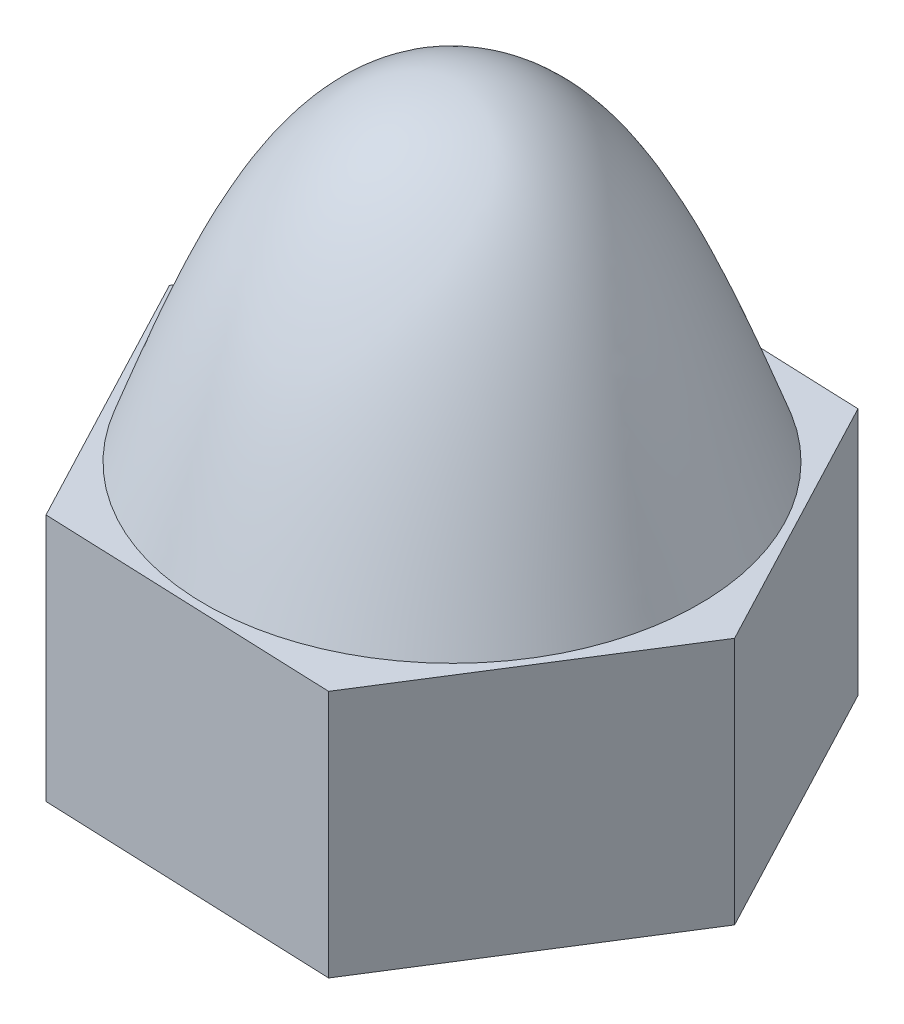
ISO-10303-21;
HEADER;
FILE_DESCRIPTION(('STEP AP214'),'2;1');
FILE_NAME('part.step','',(''),(''),'','','');
FILE_SCHEMA(('AUTOMOTIVE_DESIGN { 1 0 10303 214 1 1 1 1 }'));
ENDSEC;
DATA;
#1=APPLICATION_CONTEXT('core data for automotive mechanical design processes');
#2=APPLICATION_PROTOCOL_DEFINITION('international standard','automotive_design',2000,#1);
#3=PRODUCT_CONTEXT('',#1,'mechanical');
#4=PRODUCT('Part','Part','',(#3));
#5=PRODUCT_RELATED_PRODUCT_CATEGORY('part','',(#4));
#6=PRODUCT_DEFINITION_FORMATION('','',#4);
#7=PRODUCT_DEFINITION_CONTEXT('part definition',#1,'design');
#8=PRODUCT_DEFINITION('design','',#6,#7);
#9=PRODUCT_DEFINITION_SHAPE('','',#8);
#10=(LENGTH_UNIT() NAMED_UNIT(*) SI_UNIT(.MILLI.,.METRE.));
#11=(NAMED_UNIT(*) PLANE_ANGLE_UNIT() SI_UNIT($,.RADIAN.));
#12=(NAMED_UNIT(*) SI_UNIT($,.STERADIAN.) SOLID_ANGLE_UNIT());
#13=UNCERTAINTY_MEASURE_WITH_UNIT(LENGTH_MEASURE(1.E-05),#10,'distance_accuracy_value','');
#14=(GEOMETRIC_REPRESENTATION_CONTEXT(3) GLOBAL_UNCERTAINTY_ASSIGNED_CONTEXT((#13)) GLOBAL_UNIT_ASSIGNED_CONTEXT((#10,
#11,#12)) REPRESENTATION_CONTEXT('',''));
#15=CARTESIAN_POINT('',(0.,0.,0.));
#16=DIRECTION('',(0.,0.,1.));
#17=DIRECTION('',(1.,0.,0.));
#18=AXIS2_PLACEMENT_3D('',#15,#16,#17);
#19=CARTESIAN_POINT('',(0.,4.445,0.));
#20=DIRECTION('',(0.,1.,0.));
#21=DIRECTION('',(0.,0.,1.));
#22=AXIS2_PLACEMENT_3D('',#19,#20,#21);
#23=PLANE('',#22);
#24=DIRECTION('',(0.999234008719932,0.,0.039133052749487));
#25=VECTOR('',#24,1.);
#26=CARTESIAN_POINT('',(-2.81164997647716,4.445,4.45744841977833));
#27=LINE('',#26,#25);
#28=CARTESIAN_POINT('',(-2.81164997647716,4.445,4.45744841977833));
#29=VERTEX_POINT('',#28);
#30=CARTESIAN_POINT('',(2.45443857934825,4.445,4.66368451606831));
#31=VERTEX_POINT('',#30);
#32=EDGE_CURVE('E159',#29,#31,#27,.T.);
#33=ORIENTED_EDGE('',*,*,#32,.T.);
#34=DIRECTION('',(0.533507222168658,0.,-0.845795509502079));
#35=VECTOR('',#34,1.);
#36=CARTESIAN_POINT('',(2.45443857934825,4.445,4.66368451606831));
#37=LINE('',#36,#35);
#38=CARTESIAN_POINT('',(5.26608855582541,4.445,0.206236096289978));
#39=VERTEX_POINT('',#38);
#40=EDGE_CURVE('E116',#31,#39,#37,.T.);
#41=ORIENTED_EDGE('',*,*,#40,.T.);
#42=DIRECTION('',(-0.465726786551274,0.,-0.884928562251566));
#43=VECTOR('',#42,1.);
#44=CARTESIAN_POINT('',(5.26608855582541,4.445,0.206236096289978));
#45=LINE('',#44,#43);
#46=CARTESIAN_POINT('',(2.81164997647716,4.445,-4.45744841977833));
#47=VERTEX_POINT('',#46);
#48=EDGE_CURVE('E131',#39,#47,#45,.T.);
#49=ORIENTED_EDGE('',*,*,#48,.T.);
#50=DIRECTION('',(-0.999234008719933,0.,-0.0391330527494867));
#51=VECTOR('',#50,1.);
#52=CARTESIAN_POINT('',(2.81164997647716,4.445,-4.45744841977833));
#53=LINE('',#52,#51);
#54=CARTESIAN_POINT('',(-2.45443857934825,4.445,-4.66368451606831));
#55=VERTEX_POINT('',#54);
#56=EDGE_CURVE('E125',#47,#55,#53,.T.);
#57=ORIENTED_EDGE('',*,*,#56,.T.);
#58=DIRECTION('',(-0.533507222168658,0.,0.845795509502079));
#59=VECTOR('',#58,1.);
#60=CARTESIAN_POINT('',(-2.45443857934825,4.445,-4.66368451606831));
#61=LINE('',#60,#59);
#62=CARTESIAN_POINT('',(-5.26608855582541,4.445,-0.206236096289979));
#63=VERTEX_POINT('',#62);
#64=EDGE_CURVE('E129',#55,#63,#61,.T.);
#65=ORIENTED_EDGE('',*,*,#64,.T.);
#66=DIRECTION('',(0.465726786551274,0.,0.884928562251566));
#67=VECTOR('',#66,1.);
#68=CARTESIAN_POINT('',(-5.26608855582541,4.445,-0.206236096289979));
#69=LINE('',#68,#67);
#70=EDGE_CURVE('E78',#63,#29,#69,.T.);
#71=ORIENTED_EDGE('',*,*,#70,.T.);
#72=EDGE_LOOP('',(#33,#41,#49,#57,#65,#71));
#73=FACE_BOUND('',#72,.T.);
#74=CARTESIAN_POINT('',(4.35662282921079,4.445,0.743439092326554));
#75=CARTESIAN_POINT('',(4.32174660966076,4.445,0.947805953624223));
#76=CARTESIAN_POINT('',(4.27272886803755,4.445,1.1497762990178));
#77=CARTESIAN_POINT('',(4.14669023723,4.445,1.54493851260189));
#78=CARTESIAN_POINT('',(4.0696603076262,4.445,1.73812752410831));
#79=CARTESIAN_POINT('',(3.92528740802944,4.445,2.03672217537225));
#80=CARTESIAN_POINT('',(3.86641259978012,4.445,2.1463075688652));
#81=CARTESIAN_POINT('',(3.73955707927642,4.445,2.36011960040588));
#82=CARTESIAN_POINT('',(3.67157521385771,4.445,2.46434555750821));
#83=CARTESIAN_POINT('',(3.52701154421101,4.445,2.66670114308955));
#84=CARTESIAN_POINT('',(3.45042658302859,4.445,2.76482851300616));
#85=CARTESIAN_POINT('',(3.28922958510174,4.445,2.95431114364019));
#86=CARTESIAN_POINT('',(3.2046148016584,4.445,3.04566406790219));
#87=CARTESIAN_POINT('',(3.02845314386114,4.445,3.22049898102683));
#88=CARTESIAN_POINT('',(2.93694306018866,4.445,3.30401805403218));
#89=CARTESIAN_POINT('',(2.74727869081726,4.445,3.46313663175775));
#90=CARTESIAN_POINT('',(2.64912438577245,4.445,3.53873611341698));
#91=CARTESIAN_POINT('',(2.44685223007545,4.445,3.681502329137));
#92=CARTESIAN_POINT('',(2.34273392601378,4.445,3.748668420812));
#93=CARTESIAN_POINT('',(2.1292960939979,4.445,3.874063853559));
#94=CARTESIAN_POINT('',(2.01997836514628,4.445,3.93229625681199));
#95=CARTESIAN_POINT('',(1.79564032251638,4.445,4.04000556842794));
#96=CARTESIAN_POINT('',(1.68057084029235,4.445,4.08938012841029));
#97=CARTESIAN_POINT('',(1.44670190072492,4.445,4.17817516175765));
#98=CARTESIAN_POINT('',(1.32790386201786,4.445,4.21759937061281));
#99=CARTESIAN_POINT('',(1.08735330694327,4.445,4.28619848653747));
#100=CARTESIAN_POINT('',(0.965600108000928,4.445,4.31537100114471));
#101=CARTESIAN_POINT('',(0.720092730473457,4.445,4.36319731561211));
#102=CARTESIAN_POINT('',(0.596339342986113,4.445,4.38185517424992));
#103=CARTESIAN_POINT('',(0.348925387655618,4.445,4.40838790727491));
#104=CARTESIAN_POINT('',(0.225276079028581,4.445,4.41636792101823));
#105=CARTESIAN_POINT('',(-0.0222551581239229,4.445,4.42185851413617));
#106=CARTESIAN_POINT('',(-0.146137088319347,4.445,4.41936901806228));
#107=CARTESIAN_POINT('',(-0.393279203472097,4.445,4.40400154869783));
#108=CARTESIAN_POINT('',(-0.516539238901565,4.445,4.3911211866009));
#109=CARTESIAN_POINT('',(-0.761577247689886,4.445,4.35523029317141));
#110=CARTESIAN_POINT('',(-0.883355174571041,4.445,4.33221944499203));
#111=CARTESIAN_POINT('',(-1.12538543180522,4.445,4.27596019345461));
#112=CARTESIAN_POINT('',(-1.24562214579,4.445,4.24264445724496));
#113=CARTESIAN_POINT('',(-1.48283327386176,4.445,4.1659385135933));
#114=CARTESIAN_POINT('',(-1.59980786353029,4.445,4.12254884955018));
#115=CARTESIAN_POINT('',(-1.82960197766819,4.445,4.02597983248773));
#116=CARTESIAN_POINT('',(-1.94242277112203,4.445,3.97280349958063));
#117=CARTESIAN_POINT('',(-2.1631229874928,4.445,3.85703115818201));
#118=CARTESIAN_POINT('',(-2.27100240963344,4.445,3.79443514821068));
#119=CARTESIAN_POINT('',(-2.48024703320178,4.445,3.66081113795548));
#120=CARTESIAN_POINT('',(-2.58165564755156,4.445,3.58985109828074));
#121=CARTESIAN_POINT('',(-2.77812452189076,4.445,3.43968046136258));
#122=CARTESIAN_POINT('',(-2.87318633476911,4.445,3.36047189453907));
#123=CARTESIAN_POINT('',(-3.05634719393342,4.445,3.19437641034296));
#124=CARTESIAN_POINT('',(-3.14444661016464,4.445,3.10748990145629));
#125=CARTESIAN_POINT('',(-3.31316102389343,4.445,2.92661226222991));
#126=CARTESIAN_POINT('',(-3.39376859369692,4.445,2.83261424524259));
#127=CARTESIAN_POINT('',(-3.6241649073268,4.445,2.54006005302365));
#128=CARTESIAN_POINT('',(-3.76173673322735,4.445,2.33166194350997));
#129=CARTESIAN_POINT('',(-4.00008269430208,4.445,1.8947881075221));
#130=CARTESIAN_POINT('',(-4.10085859547328,4.445,1.66631334526723));
#131=CARTESIAN_POINT('',(-4.22227558593048,4.445,1.31302048118642));
#132=CARTESIAN_POINT('',(-4.25784553310922,4.445,1.19315474609166));
#133=CARTESIAN_POINT('',(-4.31862987808154,4.445,0.950914356536398));
#134=CARTESIAN_POINT('',(-4.34385404788537,4.445,0.828542184775782));
#135=CARTESIAN_POINT('',(-4.38377444030423,4.445,0.58203988998001));
#136=CARTESIAN_POINT('',(-4.39846561353281,4.445,0.457908952852633));
#137=CARTESIAN_POINT('',(-4.41720066340692,4.445,0.208818565773393));
#138=CARTESIAN_POINT('',(-4.42124234662736,4.445,0.0838589504550177));
#139=CARTESIAN_POINT('',(-4.41869891906101,4.445,-0.164456386271367));
#140=CARTESIAN_POINT('',(-4.41224008926696,4.445,-0.28781344698269));
#141=CARTESIAN_POINT('',(-4.38908166933431,4.445,-0.533562991643465));
#142=CARTESIAN_POINT('',(-4.37238169569248,4.445,-0.655955439296907));
#143=CARTESIAN_POINT('',(-4.32898110670289,4.445,-0.898982379617695));
#144=CARTESIAN_POINT('',(-4.30227831663326,4.445,-1.01961648407243));
#145=CARTESIAN_POINT('',(-4.23891032773645,4.445,-1.25817929634705));
#146=CARTESIAN_POINT('',(-4.2022500752665,4.445,-1.37610931596017));
#147=CARTESIAN_POINT('',(-4.11858811223253,4.445,-1.61001845621786));
#148=CARTESIAN_POINT('',(-4.07145524156516,4.445,-1.72595071300299));
#149=CARTESIAN_POINT('',(-3.96746228753433,4.445,-1.95333748940981));
#150=CARTESIAN_POINT('',(-3.91060410913626,4.445,-2.0647928806776));
#151=CARTESIAN_POINT('',(-3.78759716478127,4.445,-2.28239332844595));
#152=CARTESIAN_POINT('',(-3.72145273089637,4.445,-2.3885408299603));
#153=CARTESIAN_POINT('',(-3.58032605984945,4.445,-2.59489464870174));
#154=CARTESIAN_POINT('',(-3.50533567048114,4.445,-2.69509535568276));
#155=CARTESIAN_POINT('',(-3.27007661002213,4.445,-2.98304054375815));
#156=CARTESIAN_POINT('',(-3.09778741425249,4.445,-3.16117366612498));
#157=CARTESIAN_POINT('',(-2.72603802856108,4.445,-3.48638148191968));
#158=CARTESIAN_POINT('',(-2.52657636499327,4.445,-3.63345448975856));
#159=CARTESIAN_POINT('',(-2.21011113532197,4.445,-3.82850059105117));
#160=CARTESIAN_POINT('',(-2.10098292840892,4.445,-3.88956458855192));
#161=CARTESIAN_POINT('',(-1.87804749346549,4.445,-4.0022366243601));
#162=CARTESIAN_POINT('',(-1.76424486846822,4.445,-4.05385370436048));
#163=CARTESIAN_POINT('',(-1.53268011035905,4.445,-4.14727935584907));
#164=CARTESIAN_POINT('',(-1.414917700763,4.445,-4.18908724079687));
#165=CARTESIAN_POINT('',(-1.17623714221631,4.445,-4.26256197518627));
#166=CARTESIAN_POINT('',(-1.0553182667417,4.445,-4.2942264672627));
#167=CARTESIAN_POINT('',(-0.811732915307503,4.445,-4.34702114063868));
#168=CARTESIAN_POINT('',(-0.689075885892851,4.445,-4.36819490938892));
#169=CARTESIAN_POINT('',(-0.44240548769916,4.445,-4.40003400185899));
#170=CARTESIAN_POINT('',(-0.31839212218866,4.445,-4.41069935089668));
#171=CARTESIAN_POINT('',(-0.0698733053839038,4.445,-4.42146314285566));
#172=CARTESIAN_POINT('',(0.0546322749086569,4.445,-4.4215586027531));
#173=CARTESIAN_POINT('',(0.303210824147816,4.445,-4.41122714906609));
#174=CARTESIAN_POINT('',(0.427283764917807,4.445,-4.40079956253012));
#175=CARTESIAN_POINT('',(0.673463840589031,4.445,-4.36973629373552));
#176=CARTESIAN_POINT('',(0.795577955241885,4.445,-4.34915575007941));
#177=CARTESIAN_POINT('',(1.03768303686839,4.445,-4.29796375858013));
#178=CARTESIAN_POINT('',(1.15767409643252,4.445,-4.26735274932689));
#179=CARTESIAN_POINT('',(1.39463285553744,4.445,-4.19616512795155));
#180=CARTESIAN_POINT('',(1.51160132398927,4.445,-4.15559107844773));
#181=CARTESIAN_POINT('',(1.74169515810044,4.445,-4.06471107109416));
#182=CARTESIAN_POINT('',(1.85482051737433,4.445,-4.01440509707539));
#183=CARTESIAN_POINT('',(2.07715877970649,4.445,-3.90403140338477));
#184=CARTESIAN_POINT('',(2.18634010861473,4.445,-3.84390006596982));
#185=CARTESIAN_POINT('',(2.39923445311476,4.445,-3.71454803194461));
#186=CARTESIAN_POINT('',(2.50294536931013,4.445,-3.64532388082145));
#187=CARTESIAN_POINT('',(2.70410639559251,4.445,-3.49834973024277));
#188=CARTESIAN_POINT('',(2.80155771999236,4.445,-3.42060139238399));
#189=CARTESIAN_POINT('',(2.9895847238408,4.445,-3.2571304209544));
#190=CARTESIAN_POINT('',(3.08015795276731,4.445,-3.17140496928664));
#191=CARTESIAN_POINT('',(3.25323235240299,4.445,-2.99319868833567));
#192=CARTESIAN_POINT('',(3.33578028567301,4.445,-2.90076325996864));
#193=CARTESIAN_POINT('',(3.49288218353617,4.445,-2.70933196240181));
#194=CARTESIAN_POINT('',(3.56743612770504,4.445,-2.61033607644139));
#195=CARTESIAN_POINT('',(3.70805800775874,4.445,-2.40644575416624));
#196=CARTESIAN_POINT('',(3.77412336599426,4.445,-2.30154953999147));
#197=CARTESIAN_POINT('',(3.89724959305672,4.445,-2.08664687609502));
#198=CARTESIAN_POINT('',(3.95431354127313,4.445,-1.97664219072805));
#199=CARTESIAN_POINT('',(4.05959926523972,4.445,-1.75104236907643));
#200=CARTESIAN_POINT('',(4.10771998258397,4.445,-1.63540003709943));
#201=CARTESIAN_POINT('',(4.19395559726147,4.445,-1.40049146772567));
#202=CARTESIAN_POINT('',(4.2320741496722,4.445,-1.28122657194367));
#203=CARTESIAN_POINT('',(4.29799271041467,4.445,-1.03993754123425));
#204=CARTESIAN_POINT('',(4.32579798750337,4.445,-0.917914849083959));
#205=CARTESIAN_POINT('',(4.37088106508812,4.445,-0.671980102196804));
#206=CARTESIAN_POINT('',(4.38816060075026,4.445,-0.548068362323102));
#207=CARTESIAN_POINT('',(4.41875709384328,4.445,-0.229316949555729));
#208=CARTESIAN_POINT('',(4.42441170231475,4.445,-0.0336875699099584));
#209=CARTESIAN_POINT('',(4.40976040557536,4.445,0.356482243147101));
#210=CARTESIAN_POINT('',(4.38945961060927,4.445,0.551022883342163));
#211=CARTESIAN_POINT('',(4.35662282921079,4.445,0.743439092326554));
#212=B_SPLINE_CURVE_WITH_KNOTS('',3,(#74,#75,#76,#77,#78,#79,#80,#81,#82,#83,#84,#85,#86,#87,
#88,#89,#90,#91,#92,#93,#94,#95,#96,#97,#98,#99,#100,#101,#102,#103,#104,#105,#106,#107,#108,
#109,#110,#111,#112,#113,#114,#115,#116,#117,#118,#119,#120,#121,#122,#123,#124,#125,#126,#127,
#128,#129,#130,#131,#132,#133,#134,#135,#136,#137,#138,#139,#140,#141,#142,#143,#144,#145,#146,
#147,#148,#149,#150,#151,#152,#153,#154,#155,#156,#157,#158,#159,#160,#161,#162,#163,#164,#165,
#166,#167,#168,#169,#170,#171,#172,#173,#174,#175,#176,#177,#178,#179,#180,#181,#182,#183,#184,
#185,#186,#187,#188,#189,#190,#191,#192,#193,#194,#195,#196,#197,#198,#199,#200,#201,#202,#203,
#204,#205,#206,#207,#208,#209,#210,#211),.UNSPECIFIED.,.T.,.F.,(4,2,2,2,2,2,2,2,2,2,2,2,2,2,2,2,
2,2,2,2,2,2,2,2,2,2,2,2,2,2,2,2,2,2,2,2,2,2,2,2,2,2,2,2,2,2,2,2,2,2,2,2,2,2,2,2,2,2,2,2,2,2,2,2,
2,2,2,2,4),(0.,0.621497637898288,1.24319603101593,1.61599783751249,1.98884689404845,
2.36183321936241,2.73494759227537,3.10619568064832,3.47744485002564,3.84872228095584,
4.21987216421474,4.59506739218132,4.9701215568073,5.34526319068006,5.72025991622148,
6.09153637875619,6.46281551689926,6.83418003452876,7.20555616799036,7.579412076117,
7.95324782272298,8.32696839852211,8.70068903303143,9.07155896031975,9.44233781078588,
9.81309694674253,10.1842198311046,10.9296297179511,11.6750038246202,12.0497193735743,
12.4240801687238,12.7986203079647,13.1732375834392,13.5433828795981,13.9135420375464,
14.2837817189021,14.6538378194501,15.0288197572179,15.4037283285369,15.7784625812274,
16.1535449178537,16.8933327412467,17.63316070158,18.0079412004362,18.382361097383,
18.7568071919698,19.1313402463017,19.5043038395986,19.8772665343149,20.2503344859329,
20.6234262968545,20.9945138661959,21.3655852116085,21.7365612126339,22.1075378300194,
22.481019275842,22.8546430261806,23.2281940761002,23.6018775960833,23.9732336571442,
24.3445906669798,24.7160601781439,25.0874023323962,25.46271467075,25.8378896676209,
26.2128727334757,26.5877939667161,27.1730638310673,27.7582184819623),.UNSPECIFIED.);
#213=CARTESIAN_POINT('',(4.35662282921079,4.445,0.743439092326554));
#214=VERTEX_POINT('',#213);
#215=EDGE_CURVE('E60',#214,#214,#212,.F.);
#216=ORIENTED_EDGE('',*,*,#215,.F.);
#217=EDGE_LOOP('',(#216));
#218=FACE_BOUND('',#217,.T.);
#219=ADVANCED_FACE('F56',(#73,#218),#23,.T.);
#220=CARTESIAN_POINT('',(-2.81164997647716,4.445,4.45744841977833));
#221=DIRECTION('',(0.039133052749487,0.,-0.999234008719932));
#222=DIRECTION('',(-0.999234008719933,0.,-0.039133052749487));
#223=AXIS2_PLACEMENT_3D('',#220,#221,#222);
#224=PLANE('',#223);
#225=DIRECTION('',(0.999234008719932,0.,0.039133052749487));
#226=VECTOR('',#225,1.);
#227=CARTESIAN_POINT('',(-2.81164997647716,0.,4.45744841977833));
#228=LINE('',#227,#226);
#229=CARTESIAN_POINT('',(-2.81164997647716,0.,4.45744841977833));
#230=VERTEX_POINT('',#229);
#231=CARTESIAN_POINT('',(2.45443857934825,0.,4.66368451606831));
#232=VERTEX_POINT('',#231);
#233=EDGE_CURVE('E149',#230,#232,#228,.T.);
#234=ORIENTED_EDGE('',*,*,#233,.T.);
#235=DIRECTION('',(0.,-1.,0.));
#236=VECTOR('',#235,1.);
#237=CARTESIAN_POINT('',(2.45443857934825,4.445,4.66368451606831));
#238=LINE('',#237,#236);
#239=EDGE_CURVE('E12',#31,#232,#238,.T.);
#240=ORIENTED_EDGE('',*,*,#239,.F.);
#241=ORIENTED_EDGE('',*,*,#32,.F.);
#242=DIRECTION('',(0.,-1.,0.));
#243=VECTOR('',#242,1.);
#244=CARTESIAN_POINT('',(-2.81164997647716,4.445,4.45744841977833));
#245=LINE('',#244,#243);
#246=EDGE_CURVE('E145',#29,#230,#245,.T.);
#247=ORIENTED_EDGE('',*,*,#246,.T.);
#248=EDGE_LOOP('',(#234,#240,#241,#247));
#249=FACE_BOUND('',#248,.T.);
#250=ADVANCED_FACE('F58',(#249),#224,.F.);
#251=CARTESIAN_POINT('',(2.45443857934825,4.445,4.66368451606831));
#252=DIRECTION('',(-0.845795509502079,0.,-0.533507222168658));
#253=DIRECTION('',(-0.533507222168658,0.,0.84579550950208));
#254=AXIS2_PLACEMENT_3D('',#251,#252,#253);
#255=PLANE('',#254);
#256=DIRECTION('',(0.533507222168658,0.,-0.845795509502079));
#257=VECTOR('',#256,1.);
#258=CARTESIAN_POINT('',(2.45443857934825,0.,4.66368451606831));
#259=LINE('',#258,#257);
#260=CARTESIAN_POINT('',(5.26608855582541,0.,0.206236096289978));
#261=VERTEX_POINT('',#260);
#262=EDGE_CURVE('E152',#232,#261,#259,.T.);
#263=ORIENTED_EDGE('',*,*,#262,.T.);
#264=DIRECTION('',(0.,-1.,0.));
#265=VECTOR('',#264,1.);
#266=CARTESIAN_POINT('',(5.26608855582541,4.445,0.206236096289978));
#267=LINE('',#266,#265);
#268=EDGE_CURVE('E70',#39,#261,#267,.T.);
#269=ORIENTED_EDGE('',*,*,#268,.F.);
#270=ORIENTED_EDGE('',*,*,#40,.F.);
#271=ORIENTED_EDGE('',*,*,#239,.T.);
#272=EDGE_LOOP('',(#263,#269,#270,#271));
#273=FACE_BOUND('',#272,.T.);
#274=ADVANCED_FACE('F188',(#273),#255,.F.);
#275=CARTESIAN_POINT('',(5.26608855582541,4.445,0.206236096289978));
#276=DIRECTION('',(-0.884928562251566,0.,0.465726786551274));
#277=DIRECTION('',(0.465726786551274,0.,0.884928562251566));
#278=AXIS2_PLACEMENT_3D('',#275,#276,#277);
#279=PLANE('',#278);
#280=DIRECTION('',(-0.465726786551274,0.,-0.884928562251566));
#281=VECTOR('',#280,1.);
#282=CARTESIAN_POINT('',(5.26608855582541,0.,0.206236096289978));
#283=LINE('',#282,#281);
#284=CARTESIAN_POINT('',(2.81164997647716,0.,-4.45744841977833));
#285=VERTEX_POINT('',#284);
#286=EDGE_CURVE('E154',#261,#285,#283,.T.);
#287=ORIENTED_EDGE('',*,*,#286,.T.);
#288=DIRECTION('',(0.,-1.,0.));
#289=VECTOR('',#288,1.);
#290=CARTESIAN_POINT('',(2.81164997647716,4.445,-4.45744841977833));
#291=LINE('',#290,#289);
#292=EDGE_CURVE('E140',#47,#285,#291,.T.);
#293=ORIENTED_EDGE('',*,*,#292,.F.);
#294=ORIENTED_EDGE('',*,*,#48,.F.);
#295=ORIENTED_EDGE('',*,*,#268,.T.);
#296=EDGE_LOOP('',(#287,#293,#294,#295));
#297=FACE_BOUND('',#296,.T.);
#298=ADVANCED_FACE('F166',(#297),#279,.F.);
#299=CARTESIAN_POINT('',(2.81164997647716,4.445,-4.45744841977833));
#300=DIRECTION('',(-0.0391330527494867,0.,0.999234008719932));
#301=DIRECTION('',(0.999234008719933,0.,0.0391330527494867));
#302=AXIS2_PLACEMENT_3D('',#299,#300,#301);
#303=PLANE('',#302);
#304=DIRECTION('',(-0.999234008719933,0.,-0.0391330527494867));
#305=VECTOR('',#304,1.);
#306=CARTESIAN_POINT('',(2.81164997647716,0.,-4.45744841977833));
#307=LINE('',#306,#305);
#308=CARTESIAN_POINT('',(-2.45443857934825,0.,-4.66368451606831));
#309=VERTEX_POINT('',#308);
#310=EDGE_CURVE('E139',#285,#309,#307,.T.);
#311=ORIENTED_EDGE('',*,*,#310,.T.);
#312=DIRECTION('',(0.,-1.,0.));
#313=VECTOR('',#312,1.);
#314=CARTESIAN_POINT('',(-2.45443857934825,4.445,-4.66368451606831));
#315=LINE('',#314,#313);
#316=EDGE_CURVE('E136',#55,#309,#315,.T.);
#317=ORIENTED_EDGE('',*,*,#316,.F.);
#318=ORIENTED_EDGE('',*,*,#56,.F.);
#319=ORIENTED_EDGE('',*,*,#292,.T.);
#320=EDGE_LOOP('',(#311,#317,#318,#319));
#321=FACE_BOUND('',#320,.T.);
#322=ADVANCED_FACE('F137',(#321),#303,.F.);
#323=CARTESIAN_POINT('',(-2.45443857934825,4.445,-4.66368451606831));
#324=DIRECTION('',(0.845795509502079,0.,0.533507222168658));
#325=DIRECTION('',(0.533507222168658,0.,-0.845795509502079));
#326=AXIS2_PLACEMENT_3D('',#323,#324,#325);
#327=PLANE('',#326);
#328=DIRECTION('',(-0.533507222168658,0.,0.845795509502079));
#329=VECTOR('',#328,1.);
#330=CARTESIAN_POINT('',(-2.45443857934825,0.,-4.66368451606831));
#331=LINE('',#330,#329);
#332=CARTESIAN_POINT('',(-5.26608855582541,0.,-0.206236096289979));
#333=VERTEX_POINT('',#332);
#334=EDGE_CURVE('E102',#309,#333,#331,.T.);
#335=ORIENTED_EDGE('',*,*,#334,.T.);
#336=DIRECTION('',(0.,-1.,0.));
#337=VECTOR('',#336,1.);
#338=CARTESIAN_POINT('',(-5.26608855582541,4.445,-0.206236096289979));
#339=LINE('',#338,#337);
#340=EDGE_CURVE('E141',#63,#333,#339,.T.);
#341=ORIENTED_EDGE('',*,*,#340,.F.);
#342=ORIENTED_EDGE('',*,*,#64,.F.);
#343=ORIENTED_EDGE('',*,*,#316,.T.);
#344=EDGE_LOOP('',(#335,#341,#342,#343));
#345=FACE_BOUND('',#344,.T.);
#346=ADVANCED_FACE('F143',(#345),#327,.F.);
#347=CARTESIAN_POINT('',(-5.26608855582541,4.445,-0.206236096289979));
#348=DIRECTION('',(0.884928562251566,0.,-0.465726786551274));
#349=DIRECTION('',(-0.465726786551274,0.,-0.884928562251566));
#350=AXIS2_PLACEMENT_3D('',#347,#348,#349);
#351=PLANE('',#350);
#352=DIRECTION('',(0.465726786551274,0.,0.884928562251566));
#353=VECTOR('',#352,1.);
#354=CARTESIAN_POINT('',(-5.26608855582541,0.,-0.206236096289979));
#355=LINE('',#354,#353);
#356=EDGE_CURVE('E108',#333,#230,#355,.T.);
#357=ORIENTED_EDGE('',*,*,#356,.T.);
#358=ORIENTED_EDGE('',*,*,#246,.F.);
#359=ORIENTED_EDGE('',*,*,#70,.F.);
#360=ORIENTED_EDGE('',*,*,#340,.T.);
#361=EDGE_LOOP('',(#357,#358,#359,#360));
#362=FACE_BOUND('',#361,.T.);
#363=ADVANCED_FACE('F173',(#362),#351,.F.);
#364=CARTESIAN_POINT('',(0.,0.,0.));
#365=DIRECTION('',(0.,1.,0.));
#366=DIRECTION('',(0.,0.,1.));
#367=AXIS2_PLACEMENT_3D('',#364,#365,#366);
#368=PLANE('',#367);
#369=CARTESIAN_POINT('',(0.,0.,0.));
#370=DIRECTION('',(0.,-1.,0.));
#371=DIRECTION('',(0.,0.,-1.));
#372=AXIS2_PLACEMENT_3D('',#369,#370,#371);
#373=CIRCLE('',#372,2.01929999999999);
#374=CARTESIAN_POINT('',(0.,0.,-2.01929999999999));
#375=VERTEX_POINT('',#374);
#376=EDGE_CURVE('E216',#375,#375,#373,.T.);
#377=ORIENTED_EDGE('',*,*,#376,.F.);
#378=EDGE_LOOP('',(#377));
#379=FACE_BOUND('',#378,.T.);
#380=ORIENTED_EDGE('',*,*,#233,.F.);
#381=ORIENTED_EDGE('',*,*,#356,.F.);
#382=ORIENTED_EDGE('',*,*,#334,.F.);
#383=ORIENTED_EDGE('',*,*,#310,.F.);
#384=ORIENTED_EDGE('',*,*,#286,.F.);
#385=ORIENTED_EDGE('',*,*,#262,.F.);
#386=EDGE_LOOP('',(#380,#381,#382,#383,#384,#385));
#387=FACE_BOUND('',#386,.T.);
#388=ADVANCED_FACE('F169',(#379,#387),#368,.F.);
#389=CARTESIAN_POINT('',(0.,10.31875,0.));
#390=CARTESIAN_POINT('',(-2.30901009948172,10.31875,-0.394022718933073));
#391=CARTESIAN_POINT('',(-3.33281646434626,7.381875,-0.568730905629813));
#392=CARTESIAN_POINT('',(-4.35662282921079,4.445,-0.743439092326553));
#393=CARTESIAN_POINT('',(0.,10.31875,0.));
#394=CARTESIAN_POINT('',(-2.29819571045368,10.31875,-0.457396053224757));
#395=CARTESIAN_POINT('',(-3.31715138998177,7.381875,-0.660529711076031));
#396=CARTESIAN_POINT('',(-4.33610706950986,4.445,-0.863663368927306));
#397=CARTESIAN_POINT('',(0.,10.31875,0.));
#398=CARTESIAN_POINT('',(-2.27138730470011,10.31875,-0.583258840447502));
#399=CARTESIAN_POINT('',(-3.27854406240034,7.381875,-0.841721700955339));
#400=CARTESIAN_POINT('',(-4.28570082010057,4.445,-1.10018456146318));
#401=CARTESIAN_POINT('',(0.,10.31875,0.));
#402=CARTESIAN_POINT('',(-2.21717155443891,10.31875,-0.764347947648395));
#403=CARTESIAN_POINT('',(-3.200227800826,7.381875,-1.10329966178682));
#404=CARTESIAN_POINT('',(-4.1832840472131,4.445,-1.44225137592524));
#405=CARTESIAN_POINT('',(0.,10.31875,0.));
#406=CARTESIAN_POINT('',(-2.14925972569373,10.31875,-0.938475375057301));
#407=CARTESIAN_POINT('',(-3.10231819624727,7.381875,-1.35457284937901));
#408=CARTESIAN_POINT('',(-4.0553766668008,4.445,-1.77067032370073));
#409=CARTESIAN_POINT('',(0.,10.31875,0.));
#410=CARTESIAN_POINT('',(-1.66815269504967,10.31875,-1.93614939993792));
#411=CARTESIAN_POINT('',(-2.40552109086011,7.381875,-2.79492442805154));
#412=CARTESIAN_POINT('',(-3.14288948667055,4.445,-3.65369945616517));
#413=CARTESIAN_POINT('',(0.,10.31875,0.));
#414=CARTESIAN_POINT('',(-0.535300486523288,10.31875,-2.49251268774675));
#415=CARTESIAN_POINT('',(-0.857724909904398,7.381875,-3.58869383608622));
#416=CARTESIAN_POINT('',(-1.18014933328551,4.445,-4.6848749844257));
#417=CARTESIAN_POINT('',(0.,10.31875,0.));
#418=CARTESIAN_POINT('',(1.55567672575353,10.31875,-2.07963186415044));
#419=CARTESIAN_POINT('',(2.35180067504758,7.381875,-3.0129697496713));
#420=CARTESIAN_POINT('',(3.14792462434163,4.445,-3.94630763519216));
#421=CARTESIAN_POINT('',(0.,10.31875,0.));
#422=CARTESIAN_POINT('',(2.5034391109137,10.31875,-0.745349529053821));
#423=CARTESIAN_POINT('',(3.63518856707156,7.381875,-1.20319798437117));
#424=CARTESIAN_POINT('',(4.76693802322942,4.445,-1.66104643968852));
#425=CARTESIAN_POINT('',(0.,10.31875,0.));
#426=CARTESIAN_POINT('',(2.11458108804975,10.31875,1.53339496691997));
#427=CARTESIAN_POINT('',(3.03044436162096,7.381875,2.3406597956308));
#428=CARTESIAN_POINT('',(3.94630763519216,4.445,3.14792462434163));
#429=CARTESIAN_POINT('',(0.,10.31875,0.));
#430=CARTESIAN_POINT('',(0.777960680025615,10.31875,2.47785712779714));
#431=CARTESIAN_POINT('',(1.21950355985707,7.381875,3.62239757551328));
#432=CARTESIAN_POINT('',(1.66104643968853,4.445,4.76693802322942));
#433=CARTESIAN_POINT('',(0.,10.31875,0.));
#434=CARTESIAN_POINT('',(-1.33160943810002,10.31875,2.17393247682938));
#435=CARTESIAN_POINT('',(-1.99931847801932,7.381875,3.10115157541264));
#436=CARTESIAN_POINT('',(-2.66702751793862,4.445,4.02837067399589));
#437=CARTESIAN_POINT('',(0.,10.31875,0.));
#438=CARTESIAN_POINT('',(-2.2158421610504,10.31875,1.27336225411032));
#439=CARTESIAN_POINT('',(-3.19628066533764,7.381875,1.83900086609029));
#440=CARTESIAN_POINT('',(-4.17671916962488,4.445,2.40463947807025));
#441=CARTESIAN_POINT('',(0.,10.31875,0.));
#442=CARTESIAN_POINT('',(-2.33885948235334,10.31875,0.172596986891133));
#443=CARTESIAN_POINT('',(-3.37597467985647,7.381875,0.249079818551601));
#444=CARTESIAN_POINT('',(-4.4130898773596,4.445,0.325562650212069));
#445=CARTESIAN_POINT('',(0.,10.31875,0.));
#446=CARTESIAN_POINT('',(-2.34518142163531,10.31875,-0.0141981162118992));
#447=CARTESIAN_POINT('',(-3.3850125825458,7.381875,-0.0204435047183617));
#448=CARTESIAN_POINT('',(-4.42484374345629,4.445,-0.0266888932248242));
#449=CARTESIAN_POINT('',(0.,10.31875,0.));
#450=CARTESIAN_POINT('',(-2.33627363886834,10.31875,-0.203018834697397));
#451=CARTESIAN_POINT('',(-3.3721485521087,7.381875,-0.293190609452122));
#452=CARTESIAN_POINT('',(-4.40802346534906,4.445,-0.383362384206848));
#453=CARTESIAN_POINT('',(0.,10.31875,0.));
#454=CARTESIAN_POINT('',(-2.31982448850976,10.31875,-0.330649384641389));
#455=CARTESIAN_POINT('',(-3.34848153871074,7.381875,-0.476932100183594));
#456=CARTESIAN_POINT('',(-4.37713858891172,4.445,-0.623214815725799));
#457=CARTESIAN_POINT('',(0.,10.31875,0.));
#458=CARTESIAN_POINT('',(-2.30901009948172,10.31875,-0.394022718933073));
#459=CARTESIAN_POINT('',(-3.33281646434626,7.381875,-0.568730905629813));
#460=CARTESIAN_POINT('',(-4.35662282921079,4.445,-0.743439092326553));
#461=B_SPLINE_SURFACE_WITH_KNOTS('',3,3,((#389,#390,#391,#392),(#393,#394,#395,#396),(#397,#398,
#399,#400),(#401,#402,#403,#404),(#405,#406,#407,#408),(#409,#410,#411,#412),(#413,#414,#415,
#416),(#417,#418,#419,#420),(#421,#422,#423,#424),(#425,#426,#427,#428),(#429,#430,#431,#432),
(#433,#434,#435,#436),(#437,#438,#439,#440),(#441,#442,#443,#444),(#445,#446,#447,#448),(#449,
#450,#451,#452),(#453,#454,#455,#456),(#457,#458,#459,#460)),.UNSPECIFIED.,.T.,.F.,.F.,(4,1,1,1,
1,2,2,2,1,1,1,1,4),(4,4),(0.,0.0125,0.0249999999999999,0.0375000000000001,0.05,0.25,0.5,0.75,
0.95,0.9625,0.975,0.9875,1.),(0.,1.),.UNSPECIFIED.);
#462=CARTESIAN_POINT('',(0.,10.31875,0.));
#463=VERTEX_POINT('',#462);
#464=VERTEX_LOOP('',#463);
#465=FACE_BOUND('',#464,.T.);
#466=ORIENTED_EDGE('',*,*,#215,.T.);
#467=EDGE_LOOP('',(#466));
#468=FACE_BOUND('',#467,.T.);
#469=ADVANCED_FACE('F180',(#465,#468),#461,.T.);
#470=CARTESIAN_POINT('',(0.,7.874,0.));
#471=DIRECTION('',(0.,-1.,0.));
#472=DIRECTION('',(0.,0.,-1.));
#473=AXIS2_PLACEMENT_3D('',#470,#471,#472);
#474=CONICAL_SURFACE('',#473,2.0193,1.02974425867665);
#475=CARTESIAN_POINT('',(0.,9.08731784800235,0.));
#476=VERTEX_POINT('',#475);
#477=VERTEX_LOOP('',#476);
#478=FACE_BOUND('',#477,.T.);
#479=CARTESIAN_POINT('',(0.,7.874,0.));
#480=DIRECTION('',(0.,-1.,0.));
#481=DIRECTION('',(0.,0.,-1.));
#482=AXIS2_PLACEMENT_3D('',#479,#480,#481);
#483=CIRCLE('',#482,2.0193);
#484=CARTESIAN_POINT('',(0.,7.874,-2.0193));
#485=VERTEX_POINT('',#484);
#486=EDGE_CURVE('E213',#485,#485,#483,.T.);
#487=ORIENTED_EDGE('',*,*,#486,.T.);
#488=EDGE_LOOP('',(#487));
#489=FACE_BOUND('',#488,.T.);
#490=ADVANCED_FACE('F195',(#478,#489),#474,.F.);
#491=CARTESIAN_POINT('',(0.,0.,0.));
#492=DIRECTION('',(0.,-1.,0.));
#493=DIRECTION('',(0.,0.,-1.));
#494=AXIS2_PLACEMENT_3D('',#491,#492,#493);
#495=CYLINDRICAL_SURFACE('',#494,2.01929999999999);
#496=ORIENTED_EDGE('',*,*,#486,.F.);
#497=EDGE_LOOP('',(#496));
#498=FACE_BOUND('',#497,.T.);
#499=ORIENTED_EDGE('',*,*,#376,.T.);
#500=EDGE_LOOP('',(#499));
#501=FACE_BOUND('',#500,.T.);
#502=ADVANCED_FACE('F204',(#498,#501),#495,.F.);
#503=CLOSED_SHELL('',(#219,#250,#274,#298,#322,#346,#363,#388,#469,#490,#502));
#504=MANIFOLD_SOLID_BREP('B2',#503);
#505=ADVANCED_BREP_SHAPE_REPRESENTATION('',(#18,#504),#14);
#506=SHAPE_DEFINITION_REPRESENTATION(#9,#505);
ENDSEC;
END-ISO-10303-21;
